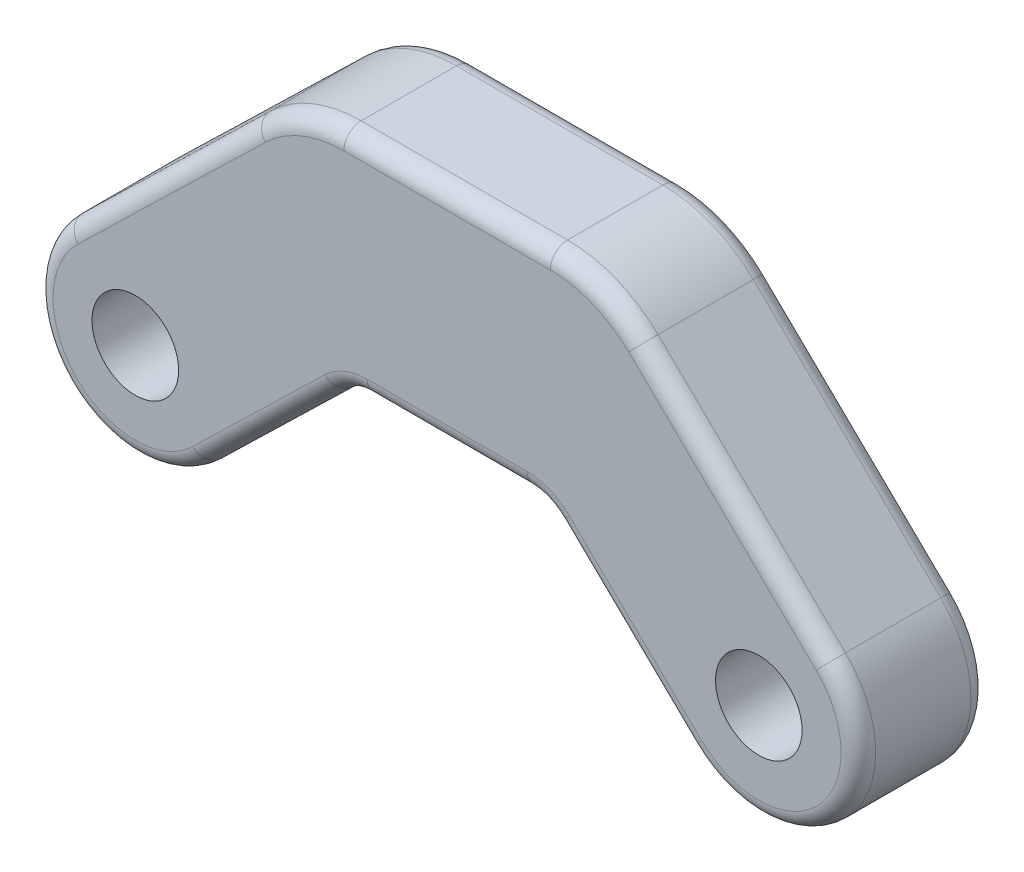
ISO-10303-21;
HEADER;
FILE_DESCRIPTION(('STEP AP214'),'2;1');
FILE_NAME('part.step','',(''),(''),'','','');
FILE_SCHEMA(('AUTOMOTIVE_DESIGN { 1 0 10303 214 1 1 1 1 }'));
ENDSEC;
DATA;
#1=APPLICATION_CONTEXT('core data for automotive mechanical design processes');
#2=APPLICATION_PROTOCOL_DEFINITION('international standard','automotive_design',2000,#1);
#3=PRODUCT_CONTEXT('',#1,'mechanical');
#4=PRODUCT('Part','Part','',(#3));
#5=PRODUCT_RELATED_PRODUCT_CATEGORY('part','',(#4));
#6=PRODUCT_DEFINITION_FORMATION('','',#4);
#7=PRODUCT_DEFINITION_CONTEXT('part definition',#1,'design');
#8=PRODUCT_DEFINITION('design','',#6,#7);
#9=PRODUCT_DEFINITION_SHAPE('','',#8);
#10=(LENGTH_UNIT() NAMED_UNIT(*) SI_UNIT(.MILLI.,.METRE.));
#11=(NAMED_UNIT(*) PLANE_ANGLE_UNIT() SI_UNIT($,.RADIAN.));
#12=(NAMED_UNIT(*) SI_UNIT($,.STERADIAN.) SOLID_ANGLE_UNIT());
#13=UNCERTAINTY_MEASURE_WITH_UNIT(LENGTH_MEASURE(1.E-05),#10,'distance_accuracy_value','');
#14=(GEOMETRIC_REPRESENTATION_CONTEXT(3) GLOBAL_UNCERTAINTY_ASSIGNED_CONTEXT((#13)) GLOBAL_UNIT_ASSIGNED_CONTEXT((#10,
#11,#12)) REPRESENTATION_CONTEXT('',''));
#15=CARTESIAN_POINT('',(0.,0.,0.));
#16=DIRECTION('',(0.,0.,1.));
#17=DIRECTION('',(1.,0.,0.));
#18=AXIS2_PLACEMENT_3D('',#15,#16,#17);
#19=CARTESIAN_POINT('',(0.,0.,15.));
#20=DIRECTION('',(0.,0.,-1.));
#21=DIRECTION('',(-1.,0.,0.));
#22=AXIS2_PLACEMENT_3D('',#19,#20,#21);
#23=CYLINDRICAL_SURFACE('',#22,11.5);
#24=DIRECTION('',(0.,0.,-1.));
#25=VECTOR('',#24,1.);
#26=CARTESIAN_POINT('',(8.00915787556776,-8.25247781725167,15.));
#27=LINE('',#26,#25);
#28=CARTESIAN_POINT('',(8.00915787556776,-8.25247781725167,13.));
#29=VERTEX_POINT('',#28);
#30=CARTESIAN_POINT('',(8.00915787556776,-8.25247781725167,2.));
#31=VERTEX_POINT('',#30);
#32=EDGE_CURVE('E334',#29,#31,#27,.T.);
#33=ORIENTED_EDGE('',*,*,#32,.F.);
#34=CARTESIAN_POINT('',(0.,0.,13.));
#35=DIRECTION('',(0.,0.,1.));
#36=DIRECTION('',(1.,0.,0.));
#37=AXIS2_PLACEMENT_3D('',#34,#35,#36);
#38=CIRCLE('',#37,11.5);
#39=CARTESIAN_POINT('',(-8.00915787556776,8.25247781725167,13.));
#40=VERTEX_POINT('',#39);
#41=EDGE_CURVE('E357',#29,#40,#38,.F.);
#42=ORIENTED_EDGE('',*,*,#41,.T.);
#43=DIRECTION('',(0.,0.,-1.));
#44=VECTOR('',#43,1.);
#45=CARTESIAN_POINT('',(-8.00915787556776,8.25247781725167,15.));
#46=LINE('',#45,#44);
#47=CARTESIAN_POINT('',(-8.00915787556776,8.25247781725167,2.));
#48=VERTEX_POINT('',#47);
#49=EDGE_CURVE('E448',#40,#48,#46,.T.);
#50=ORIENTED_EDGE('',*,*,#49,.T.);
#51=CARTESIAN_POINT('',(0.,0.,2.));
#52=DIRECTION('',(0.,0.,1.));
#53=DIRECTION('',(1.,0.,0.));
#54=AXIS2_PLACEMENT_3D('',#51,#52,#53);
#55=CIRCLE('',#54,11.5);
#56=EDGE_CURVE('E359',#48,#31,#55,.T.);
#57=ORIENTED_EDGE('',*,*,#56,.T.);
#58=EDGE_LOOP('',(#33,#42,#50,#57));
#59=FACE_BOUND('',#58,.T.);
#60=ADVANCED_FACE('F40',(#59),#23,.T.);
#61=CARTESIAN_POINT('',(8.00915787556776,-8.25247781725167,15.));
#62=DIRECTION('',(-0.696448510918936,0.717606766717537,0.));
#63=DIRECTION('',(-0.717606766717537,-0.696448510918936,0.));
#64=AXIS2_PLACEMENT_3D('',#61,#62,#63);
#65=PLANE('',#64);
#66=DIRECTION('',(0.,0.,-1.));
#67=VECTOR('',#66,1.);
#68=CARTESIAN_POINT('',(23.2951379972702,6.58280326906304,15.));
#69=LINE('',#68,#67);
#70=CARTESIAN_POINT('',(23.2951379972702,6.58280326906304,2.));
#71=VERTEX_POINT('',#70);
#72=CARTESIAN_POINT('',(23.2951379972702,6.58280326906304,13.));
#73=VERTEX_POINT('',#72);
#74=EDGE_CURVE('E427',#71,#73,#69,.F.);
#75=ORIENTED_EDGE('',*,*,#74,.T.);
#76=DIRECTION('',(0.717606766717537,0.696448510918936,0.));
#77=VECTOR('',#76,1.);
#78=CARTESIAN_POINT('',(8.00915787556776,-8.25247781725167,13.));
#79=LINE('',#78,#77);
#80=EDGE_CURVE('E365',#73,#29,#79,.F.);
#81=ORIENTED_EDGE('',*,*,#80,.T.);
#82=ORIENTED_EDGE('',*,*,#32,.T.);
#83=DIRECTION('',(0.717606766717537,0.696448510918936,0.));
#84=VECTOR('',#83,1.);
#85=CARTESIAN_POINT('',(8.00915787556776,-8.25247781725167,2.));
#86=LINE('',#85,#84);
#87=EDGE_CURVE('E367',#31,#71,#86,.T.);
#88=ORIENTED_EDGE('',*,*,#87,.T.);
#89=EDGE_LOOP('',(#75,#81,#82,#88));
#90=FACE_BOUND('',#89,.T.);
#91=ADVANCED_FACE('F488',(#90),#65,.F.);
#92=CARTESIAN_POINT('',(24.75,7.99476943547536,15.));
#93=DIRECTION('',(0.,1.,0.));
#94=DIRECTION('',(0.,0.,1.));
#95=AXIS2_PLACEMENT_3D('',#92,#93,#94);
#96=PLANE('',#95);
#97=DIRECTION('',(0.,0.,-1.));
#98=VECTOR('',#97,1.);
#99=CARTESIAN_POINT('',(45.2226194481351,7.99476943547536,15.));
#100=LINE('',#99,#98);
#101=CARTESIAN_POINT('',(45.2226194481351,7.99476943547536,2.));
#102=VERTEX_POINT('',#101);
#103=CARTESIAN_POINT('',(45.2226194481351,7.99476943547536,13.));
#104=VERTEX_POINT('',#103);
#105=EDGE_CURVE('E433',#102,#104,#100,.F.);
#106=ORIENTED_EDGE('',*,*,#105,.T.);
#107=DIRECTION('',(1.,0.,0.));
#108=VECTOR('',#107,1.);
#109=CARTESIAN_POINT('',(26.7773805518649,7.99476943547536,13.));
#110=LINE('',#109,#108);
#111=CARTESIAN_POINT('',(26.7773805518649,7.99476943547536,13.));
#112=VERTEX_POINT('',#111);
#113=EDGE_CURVE('E400',#104,#112,#110,.F.);
#114=ORIENTED_EDGE('',*,*,#113,.T.);
#115=DIRECTION('',(0.,0.,-1.));
#116=VECTOR('',#115,1.);
#117=CARTESIAN_POINT('',(26.7773805518649,7.99476943547536,0.));
#118=LINE('',#117,#116);
#119=CARTESIAN_POINT('',(26.7773805518649,7.99476943547536,2.));
#120=VERTEX_POINT('',#119);
#121=EDGE_CURVE('E430',#112,#120,#118,.T.);
#122=ORIENTED_EDGE('',*,*,#121,.T.);
#123=DIRECTION('',(1.,0.,0.));
#124=VECTOR('',#123,1.);
#125=CARTESIAN_POINT('',(24.75,7.99476943547536,2.));
#126=LINE('',#125,#124);
#127=EDGE_CURVE('E403',#120,#102,#126,.T.);
#128=ORIENTED_EDGE('',*,*,#127,.T.);
#129=EDGE_LOOP('',(#106,#114,#122,#128));
#130=FACE_BOUND('',#129,.T.);
#131=ADVANCED_FACE('F494',(#130),#96,.F.);
#132=CARTESIAN_POINT('',(47.25,7.99476943547536,15.));
#133=DIRECTION('',(0.696448510918936,0.717606766717537,0.));
#134=DIRECTION('',(-0.717606766717537,0.696448510918936,0.));
#135=AXIS2_PLACEMENT_3D('',#132,#133,#134);
#136=PLANE('',#135);
#137=DIRECTION('',(0.,0.,-1.));
#138=VECTOR('',#137,1.);
#139=CARTESIAN_POINT('',(63.9908421244322,-8.25247781725167,15.));
#140=LINE('',#139,#138);
#141=CARTESIAN_POINT('',(63.9908421244322,-8.25247781725167,13.));
#142=VERTEX_POINT('',#141);
#143=CARTESIAN_POINT('',(63.9908421244322,-8.25247781725167,2.));
#144=VERTEX_POINT('',#143);
#145=EDGE_CURVE('E443',#142,#144,#140,.T.);
#146=ORIENTED_EDGE('',*,*,#145,.F.);
#147=DIRECTION('',(0.717606766717537,-0.696448510918936,0.));
#148=VECTOR('',#147,1.);
#149=CARTESIAN_POINT('',(48.7048620027298,6.58280326906304,13.));
#150=LINE('',#149,#148);
#151=CARTESIAN_POINT('',(48.7048620027298,6.58280326906304,13.));
#152=VERTEX_POINT('',#151);
#153=EDGE_CURVE('E361',#142,#152,#150,.F.);
#154=ORIENTED_EDGE('',*,*,#153,.T.);
#155=DIRECTION('',(0.,0.,-1.));
#156=VECTOR('',#155,1.);
#157=CARTESIAN_POINT('',(48.7048620027298,6.58280326906304,0.));
#158=LINE('',#157,#156);
#159=CARTESIAN_POINT('',(48.7048620027298,6.58280326906304,2.));
#160=VERTEX_POINT('',#159);
#161=EDGE_CURVE('E224',#152,#160,#158,.T.);
#162=ORIENTED_EDGE('',*,*,#161,.T.);
#163=DIRECTION('',(0.717606766717537,-0.696448510918936,0.));
#164=VECTOR('',#163,1.);
#165=CARTESIAN_POINT('',(47.25,7.99476943547536,2.));
#166=LINE('',#165,#164);
#167=EDGE_CURVE('E363',#160,#144,#166,.T.);
#168=ORIENTED_EDGE('',*,*,#167,.T.);
#169=EDGE_LOOP('',(#146,#154,#162,#168));
#170=FACE_BOUND('',#169,.T.);
#171=ADVANCED_FACE('F711',(#170),#136,.F.);
#172=CARTESIAN_POINT('',(72.,0.,15.));
#173=DIRECTION('',(0.,0.,-1.));
#174=DIRECTION('',(-1.,0.,0.));
#175=AXIS2_PLACEMENT_3D('',#172,#173,#174);
#176=CYLINDRICAL_SURFACE('',#175,11.5);
#177=DIRECTION('',(0.,0.,-1.));
#178=VECTOR('',#177,1.);
#179=CARTESIAN_POINT('',(80.0091578755678,8.25247781725167,15.));
#180=LINE('',#179,#178);
#181=CARTESIAN_POINT('',(80.0091578755678,8.25247781725167,13.));
#182=VERTEX_POINT('',#181);
#183=CARTESIAN_POINT('',(80.0091578755678,8.25247781725167,2.));
#184=VERTEX_POINT('',#183);
#185=EDGE_CURVE('E446',#182,#184,#180,.T.);
#186=ORIENTED_EDGE('',*,*,#185,.F.);
#187=CARTESIAN_POINT('',(72.,0.,13.));
#188=DIRECTION('',(0.,0.,1.));
#189=DIRECTION('',(1.,0.,0.));
#190=AXIS2_PLACEMENT_3D('',#187,#188,#189);
#191=CIRCLE('',#190,11.5);
#192=EDGE_CURVE('E351',#182,#142,#191,.F.);
#193=ORIENTED_EDGE('',*,*,#192,.T.);
#194=ORIENTED_EDGE('',*,*,#145,.T.);
#195=CARTESIAN_POINT('',(72.,0.,2.));
#196=DIRECTION('',(0.,0.,1.));
#197=DIRECTION('',(1.,0.,0.));
#198=AXIS2_PLACEMENT_3D('',#195,#196,#197);
#199=CIRCLE('',#198,11.5);
#200=EDGE_CURVE('E353',#144,#184,#199,.T.);
#201=ORIENTED_EDGE('',*,*,#200,.T.);
#202=EDGE_LOOP('',(#186,#193,#194,#201));
#203=FACE_BOUND('',#202,.T.);
#204=ADVANCED_FACE('F720',(#203),#176,.T.);
#205=CARTESIAN_POINT('',(54.,33.4947694354754,15.));
#206=DIRECTION('',(0.696448510918936,0.717606766717537,0.));
#207=DIRECTION('',(-0.717606766717537,0.696448510918936,0.));
#208=AXIS2_PLACEMENT_3D('',#205,#206,#207);
#209=PLANE('',#208);
#210=DIRECTION('',(0.,0.,-1.));
#211=VECTOR('',#210,1.);
#212=CARTESIAN_POINT('',(58.3645860081893,29.2588709362384,15.));
#213=LINE('',#212,#211);
#214=CARTESIAN_POINT('',(58.3645860081893,29.2588709362384,2.));
#215=VERTEX_POINT('',#214);
#216=CARTESIAN_POINT('',(58.3645860081893,29.2588709362384,13.));
#217=VERTEX_POINT('',#216);
#218=EDGE_CURVE('E438',#215,#217,#213,.F.);
#219=ORIENTED_EDGE('',*,*,#218,.T.);
#220=DIRECTION('',(0.717606766717537,-0.696448510918936,0.));
#221=VECTOR('',#220,1.);
#222=CARTESIAN_POINT('',(54.,33.4947694354754,13.));
#223=LINE('',#222,#221);
#224=EDGE_CURVE('E306',#217,#182,#223,.T.);
#225=ORIENTED_EDGE('',*,*,#224,.T.);
#226=ORIENTED_EDGE('',*,*,#185,.T.);
#227=DIRECTION('',(0.717606766717537,-0.696448510918936,0.));
#228=VECTOR('',#227,1.);
#229=CARTESIAN_POINT('',(58.3645860081893,29.2588709362384,2.));
#230=LINE('',#229,#228);
#231=EDGE_CURVE('E313',#184,#215,#230,.F.);
#232=ORIENTED_EDGE('',*,*,#231,.T.);
#233=EDGE_LOOP('',(#219,#225,#226,#232));
#234=FACE_BOUND('',#233,.T.);
#235=ADVANCED_FACE('F683',(#234),#209,.T.);
#236=CARTESIAN_POINT('',(18.,33.4947694354754,15.));
#237=DIRECTION('',(0.,1.,0.));
#238=DIRECTION('',(0.,0.,1.));
#239=AXIS2_PLACEMENT_3D('',#236,#237,#238);
#240=PLANE('',#239);
#241=DIRECTION('',(0.,0.,-1.));
#242=VECTOR('',#241,1.);
#243=CARTESIAN_POINT('',(24.0821416555947,33.4947694354754,15.));
#244=LINE('',#243,#242);
#245=CARTESIAN_POINT('',(24.0821416555947,33.4947694354754,2.));
#246=VERTEX_POINT('',#245);
#247=CARTESIAN_POINT('',(24.0821416555947,33.4947694354754,13.));
#248=VERTEX_POINT('',#247);
#249=EDGE_CURVE('E326',#246,#248,#244,.F.);
#250=ORIENTED_EDGE('',*,*,#249,.T.);
#251=DIRECTION('',(1.,0.,0.));
#252=VECTOR('',#251,1.);
#253=CARTESIAN_POINT('',(18.,33.4947694354754,13.));
#254=LINE('',#253,#252);
#255=CARTESIAN_POINT('',(47.9178583444053,33.4947694354754,13.));
#256=VERTEX_POINT('',#255);
#257=EDGE_CURVE('E11',#248,#256,#254,.T.);
#258=ORIENTED_EDGE('',*,*,#257,.T.);
#259=DIRECTION('',(0.,0.,-1.));
#260=VECTOR('',#259,1.);
#261=CARTESIAN_POINT('',(47.9178583444053,33.4947694354754,15.));
#262=LINE('',#261,#260);
#263=CARTESIAN_POINT('',(47.9178583444053,33.4947694354754,2.));
#264=VERTEX_POINT('',#263);
#265=EDGE_CURVE('E327',#256,#264,#262,.T.);
#266=ORIENTED_EDGE('',*,*,#265,.T.);
#267=DIRECTION('',(1.,0.,0.));
#268=VECTOR('',#267,1.);
#269=CARTESIAN_POINT('',(24.0821416555947,33.4947694354754,2.));
#270=LINE('',#269,#268);
#271=EDGE_CURVE('E49',#264,#246,#270,.F.);
#272=ORIENTED_EDGE('',*,*,#271,.T.);
#273=EDGE_LOOP('',(#250,#258,#266,#272));
#274=FACE_BOUND('',#273,.T.);
#275=ADVANCED_FACE('F325',(#274),#240,.T.);
#276=CARTESIAN_POINT('',(-8.00915787556776,8.25247781725167,15.));
#277=DIRECTION('',(-0.696448510918936,0.717606766717537,0.));
#278=DIRECTION('',(-0.717606766717537,-0.696448510918936,0.));
#279=AXIS2_PLACEMENT_3D('',#276,#277,#278);
#280=PLANE('',#279);
#281=ORIENTED_EDGE('',*,*,#49,.F.);
#282=DIRECTION('',(0.717606766717537,0.696448510918936,0.));
#283=VECTOR('',#282,1.);
#284=CARTESIAN_POINT('',(-8.00915787556776,8.25247781725167,13.));
#285=LINE('',#284,#283);
#286=CARTESIAN_POINT('',(13.6354139918106,29.2588709362384,13.));
#287=VERTEX_POINT('',#286);
#288=EDGE_CURVE('E317',#40,#287,#285,.T.);
#289=ORIENTED_EDGE('',*,*,#288,.T.);
#290=DIRECTION('',(0.,0.,-1.));
#291=VECTOR('',#290,1.);
#292=CARTESIAN_POINT('',(13.6354139918106,29.2588709362384,15.));
#293=LINE('',#292,#291);
#294=CARTESIAN_POINT('',(13.6354139918106,29.2588709362384,2.));
#295=VERTEX_POINT('',#294);
#296=EDGE_CURVE('E436',#287,#295,#293,.T.);
#297=ORIENTED_EDGE('',*,*,#296,.T.);
#298=DIRECTION('',(0.717606766717537,0.696448510918936,0.));
#299=VECTOR('',#298,1.);
#300=CARTESIAN_POINT('',(-8.00915787556776,8.25247781725167,2.));
#301=LINE('',#300,#299);
#302=EDGE_CURVE('E345',#295,#48,#301,.F.);
#303=ORIENTED_EDGE('',*,*,#302,.T.);
#304=EDGE_LOOP('',(#281,#289,#297,#303));
#305=FACE_BOUND('',#304,.T.);
#306=ADVANCED_FACE('F474',(#305),#280,.T.);
#307=CARTESIAN_POINT('',(0.,0.,15.));
#308=DIRECTION('',(0.,0.,1.));
#309=DIRECTION('',(1.,0.,0.));
#310=AXIS2_PLACEMENT_3D('',#307,#308,#309);
#311=PLANE('',#310);
#312=CARTESIAN_POINT('',(26.7773805518649,2.99476943547536,15.));
#313=DIRECTION('',(0.,0.,1.));
#314=DIRECTION('',(1.,0.,0.));
#315=AXIS2_PLACEMENT_3D('',#312,#313,#314);
#316=CIRCLE('',#315,7.);
#317=CARTESIAN_POINT('',(21.9022409754323,8.01801680249812,15.));
#318=VERTEX_POINT('',#317);
#319=CARTESIAN_POINT('',(26.7773805518649,9.99476943547536,15.));
#320=VERTEX_POINT('',#319);
#321=EDGE_CURVE('E409',#318,#320,#316,.F.);
#322=ORIENTED_EDGE('',*,*,#321,.T.);
#323=DIRECTION('',(1.,0.,0.));
#324=VECTOR('',#323,1.);
#325=CARTESIAN_POINT('',(45.2226194481351,9.99476943547536,15.));
#326=LINE('',#325,#324);
#327=CARTESIAN_POINT('',(45.2226194481351,9.99476943547536,15.));
#328=VERTEX_POINT('',#327);
#329=EDGE_CURVE('E406',#320,#328,#326,.T.);
#330=ORIENTED_EDGE('',*,*,#329,.T.);
#331=CARTESIAN_POINT('',(45.2226194481351,2.99476943547536,15.));
#332=DIRECTION('',(0.,0.,1.));
#333=DIRECTION('',(1.,0.,0.));
#334=AXIS2_PLACEMENT_3D('',#331,#332,#333);
#335=CIRCLE('',#334,7.);
#336=CARTESIAN_POINT('',(50.0977590245676,8.01801680249812,15.));
#337=VERTEX_POINT('',#336);
#338=EDGE_CURVE('E411',#328,#337,#335,.F.);
#339=ORIENTED_EDGE('',*,*,#338,.T.);
#340=DIRECTION('',(0.717606766717537,-0.696448510918936,0.));
#341=VECTOR('',#340,1.);
#342=CARTESIAN_POINT('',(65.3837391462701,-6.81726428381661,15.));
#343=LINE('',#342,#341);
#344=CARTESIAN_POINT('',(65.3837391462701,-6.8172642838166,15.));
#345=VERTEX_POINT('',#344);
#346=EDGE_CURVE('E415',#337,#345,#343,.T.);
#347=ORIENTED_EDGE('',*,*,#346,.T.);
#348=CARTESIAN_POINT('',(72.,0.,15.));
#349=DIRECTION('',(0.,0.,1.));
#350=DIRECTION('',(1.,0.,0.));
#351=AXIS2_PLACEMENT_3D('',#348,#349,#350);
#352=CIRCLE('',#351,9.5);
#353=CARTESIAN_POINT('',(78.6162608537299,6.8172642838166,15.));
#354=VERTEX_POINT('',#353);
#355=EDGE_CURVE('E419',#345,#354,#352,.T.);
#356=ORIENTED_EDGE('',*,*,#355,.T.);
#357=DIRECTION('',(0.717606766717537,-0.696448510918936,0.));
#358=VECTOR('',#357,1.);
#359=CARTESIAN_POINT('',(41.5391788957365,42.8011480994328,15.));
#360=LINE('',#359,#358);
#361=CARTESIAN_POINT('',(56.9716889863515,27.8236574028033,15.));
#362=VERTEX_POINT('',#361);
#363=EDGE_CURVE('E209',#354,#362,#360,.F.);
#364=ORIENTED_EDGE('',*,*,#363,.T.);
#365=CARTESIAN_POINT('',(47.9178583444053,18.4947694354754,15.));
#366=DIRECTION('',(0.,0.,1.));
#367=DIRECTION('',(1.,0.,0.));
#368=AXIS2_PLACEMENT_3D('',#365,#366,#367);
#369=CIRCLE('',#368,13.);
#370=CARTESIAN_POINT('',(47.9178583444053,31.4947694354754,15.));
#371=VERTEX_POINT('',#370);
#372=EDGE_CURVE('E202',#362,#371,#369,.T.);
#373=ORIENTED_EDGE('',*,*,#372,.T.);
#374=DIRECTION('',(1.,0.,0.));
#375=VECTOR('',#374,1.);
#376=CARTESIAN_POINT('',(0.,31.4947694354754,15.));
#377=LINE('',#376,#375);
#378=CARTESIAN_POINT('',(24.0821416555947,31.4947694354754,15.));
#379=VERTEX_POINT('',#378);
#380=EDGE_CURVE('E206',#371,#379,#377,.F.);
#381=ORIENTED_EDGE('',*,*,#380,.T.);
#382=CARTESIAN_POINT('',(24.0821416555947,18.4947694354754,15.));
#383=DIRECTION('',(0.,0.,1.));
#384=DIRECTION('',(1.,0.,0.));
#385=AXIS2_PLACEMENT_3D('',#382,#383,#384);
#386=CIRCLE('',#385,13.);
#387=CARTESIAN_POINT('',(15.0283110136485,27.8236574028033,15.));
#388=VERTEX_POINT('',#387);
#389=EDGE_CURVE('E214',#379,#388,#386,.T.);
#390=ORIENTED_EDGE('',*,*,#389,.T.);
#391=DIRECTION('',(0.717606766717537,0.696448510918936,0.));
#392=VECTOR('',#391,1.);
#393=CARTESIAN_POINT('',(-6.61626085372989,6.8172642838166,15.));
#394=LINE('',#393,#392);
#395=CARTESIAN_POINT('',(-6.61626085372989,6.8172642838166,15.));
#396=VERTEX_POINT('',#395);
#397=EDGE_CURVE('E421',#388,#396,#394,.F.);
#398=ORIENTED_EDGE('',*,*,#397,.T.);
#399=CARTESIAN_POINT('',(0.,0.,15.));
#400=DIRECTION('',(0.,0.,1.));
#401=DIRECTION('',(1.,0.,0.));
#402=AXIS2_PLACEMENT_3D('',#399,#400,#401);
#403=CIRCLE('',#402,9.5);
#404=CARTESIAN_POINT('',(6.61626085372989,-6.8172642838166,15.));
#405=VERTEX_POINT('',#404);
#406=EDGE_CURVE('E417',#396,#405,#403,.T.);
#407=ORIENTED_EDGE('',*,*,#406,.T.);
#408=DIRECTION('',(0.717606766717537,0.696448510918936,0.));
#409=VECTOR('',#408,1.);
#410=CARTESIAN_POINT('',(21.9022409754323,8.01801680249812,15.));
#411=LINE('',#410,#409);
#412=EDGE_CURVE('E413',#405,#318,#411,.T.);
#413=ORIENTED_EDGE('',*,*,#412,.T.);
#414=EDGE_LOOP('',(#322,#330,#339,#347,#356,#364,#373,#381,#390,#398,#407,#413));
#415=FACE_BOUND('',#414,.T.);
#416=CARTESIAN_POINT('',(72.,0.,15.));
#417=DIRECTION('',(0.,0.,1.));
#418=DIRECTION('',(1.,0.,0.));
#419=AXIS2_PLACEMENT_3D('',#416,#417,#418);
#420=CIRCLE('',#419,5.);
#421=CARTESIAN_POINT('',(77.,0.,15.));
#422=VERTEX_POINT('',#421);
#423=EDGE_CURVE('E230',#422,#422,#420,.T.);
#424=ORIENTED_EDGE('',*,*,#423,.F.);
#425=EDGE_LOOP('',(#424));
#426=FACE_BOUND('',#425,.T.);
#427=CARTESIAN_POINT('',(0.,0.,15.));
#428=DIRECTION('',(0.,0.,1.));
#429=DIRECTION('',(1.,0.,0.));
#430=AXIS2_PLACEMENT_3D('',#427,#428,#429);
#431=CIRCLE('',#430,5.);
#432=CARTESIAN_POINT('',(5.,0.,15.));
#433=VERTEX_POINT('',#432);
#434=EDGE_CURVE('E451',#433,#433,#431,.T.);
#435=ORIENTED_EDGE('',*,*,#434,.F.);
#436=EDGE_LOOP('',(#435));
#437=FACE_BOUND('',#436,.T.);
#438=ADVANCED_FACE('F204',(#415,#426,#437),#311,.T.);
#439=CARTESIAN_POINT('',(0.,0.,0.));
#440=DIRECTION('',(0.,0.,1.));
#441=DIRECTION('',(1.,0.,0.));
#442=AXIS2_PLACEMENT_3D('',#439,#440,#441);
#443=PLANE('',#442);
#444=CARTESIAN_POINT('',(45.2226194481351,2.99476943547536,0.));
#445=DIRECTION('',(0.,0.,1.));
#446=DIRECTION('',(1.,0.,0.));
#447=AXIS2_PLACEMENT_3D('',#444,#445,#446);
#448=CIRCLE('',#447,7.);
#449=CARTESIAN_POINT('',(50.0977590245676,8.01801680249812,0.));
#450=VERTEX_POINT('',#449);
#451=CARTESIAN_POINT('',(45.2226194481351,9.99476943547536,0.));
#452=VERTEX_POINT('',#451);
#453=EDGE_CURVE('E382',#450,#452,#448,.T.);
#454=ORIENTED_EDGE('',*,*,#453,.T.);
#455=DIRECTION('',(1.,0.,0.));
#456=VECTOR('',#455,1.);
#457=CARTESIAN_POINT('',(0.,9.99476943547536,0.));
#458=LINE('',#457,#456);
#459=CARTESIAN_POINT('',(26.7773805518649,9.99476943547536,0.));
#460=VERTEX_POINT('',#459);
#461=EDGE_CURVE('E377',#452,#460,#458,.F.);
#462=ORIENTED_EDGE('',*,*,#461,.T.);
#463=CARTESIAN_POINT('',(26.7773805518649,2.99476943547536,0.));
#464=DIRECTION('',(0.,0.,1.));
#465=DIRECTION('',(1.,0.,0.));
#466=AXIS2_PLACEMENT_3D('',#463,#464,#465);
#467=CIRCLE('',#466,7.);
#468=CARTESIAN_POINT('',(21.9022409754323,8.01801680249812,0.));
#469=VERTEX_POINT('',#468);
#470=EDGE_CURVE('E380',#460,#469,#467,.T.);
#471=ORIENTED_EDGE('',*,*,#470,.T.);
#472=DIRECTION('',(0.717606766717537,0.696448510918936,0.));
#473=VECTOR('',#472,1.);
#474=CARTESIAN_POINT('',(6.61626085372989,-6.8172642838166,0.));
#475=LINE('',#474,#473);
#476=CARTESIAN_POINT('',(6.61626085372989,-6.8172642838166,0.));
#477=VERTEX_POINT('',#476);
#478=EDGE_CURVE('E384',#469,#477,#475,.F.);
#479=ORIENTED_EDGE('',*,*,#478,.T.);
#480=CARTESIAN_POINT('',(0.,0.,0.));
#481=DIRECTION('',(0.,0.,1.));
#482=DIRECTION('',(1.,0.,0.));
#483=AXIS2_PLACEMENT_3D('',#480,#481,#482);
#484=CIRCLE('',#483,9.5);
#485=CARTESIAN_POINT('',(-6.61626085372989,6.8172642838166,0.));
#486=VERTEX_POINT('',#485);
#487=EDGE_CURVE('E388',#477,#486,#484,.F.);
#488=ORIENTED_EDGE('',*,*,#487,.T.);
#489=DIRECTION('',(0.717606766717537,0.696448510918936,0.));
#490=VECTOR('',#489,1.);
#491=CARTESIAN_POINT('',(15.0283110136485,27.8236574028033,0.));
#492=LINE('',#491,#490);
#493=CARTESIAN_POINT('',(15.0283110136485,27.8236574028033,0.));
#494=VERTEX_POINT('',#493);
#495=EDGE_CURVE('E392',#486,#494,#492,.T.);
#496=ORIENTED_EDGE('',*,*,#495,.T.);
#497=CARTESIAN_POINT('',(24.0821416555947,18.4947694354754,0.));
#498=DIRECTION('',(0.,0.,1.));
#499=DIRECTION('',(1.,0.,0.));
#500=AXIS2_PLACEMENT_3D('',#497,#498,#499);
#501=CIRCLE('',#500,13.);
#502=CARTESIAN_POINT('',(24.0821416555947,31.4947694354754,0.));
#503=VERTEX_POINT('',#502);
#504=EDGE_CURVE('E341',#494,#503,#501,.F.);
#505=ORIENTED_EDGE('',*,*,#504,.T.);
#506=DIRECTION('',(1.,0.,0.));
#507=VECTOR('',#506,1.);
#508=CARTESIAN_POINT('',(47.9178583444053,31.4947694354754,0.));
#509=LINE('',#508,#507);
#510=CARTESIAN_POINT('',(47.9178583444053,31.4947694354754,0.));
#511=VERTEX_POINT('',#510);
#512=EDGE_CURVE('E337',#503,#511,#509,.T.);
#513=ORIENTED_EDGE('',*,*,#512,.T.);
#514=CARTESIAN_POINT('',(47.9178583444053,18.4947694354754,0.));
#515=DIRECTION('',(0.,0.,1.));
#516=DIRECTION('',(1.,0.,0.));
#517=AXIS2_PLACEMENT_3D('',#514,#515,#516);
#518=CIRCLE('',#517,13.);
#519=CARTESIAN_POINT('',(56.9716889863515,27.8236574028033,0.));
#520=VERTEX_POINT('',#519);
#521=EDGE_CURVE('E397',#511,#520,#518,.F.);
#522=ORIENTED_EDGE('',*,*,#521,.T.);
#523=DIRECTION('',(0.717606766717537,-0.696448510918936,0.));
#524=VECTOR('',#523,1.);
#525=CARTESIAN_POINT('',(78.6162608537299,6.81726428381661,0.));
#526=LINE('',#525,#524);
#527=CARTESIAN_POINT('',(78.6162608537299,6.8172642838166,0.));
#528=VERTEX_POINT('',#527);
#529=EDGE_CURVE('E394',#520,#528,#526,.T.);
#530=ORIENTED_EDGE('',*,*,#529,.T.);
#531=CARTESIAN_POINT('',(72.,0.,0.));
#532=DIRECTION('',(0.,0.,1.));
#533=DIRECTION('',(1.,0.,0.));
#534=AXIS2_PLACEMENT_3D('',#531,#532,#533);
#535=CIRCLE('',#534,9.5);
#536=CARTESIAN_POINT('',(65.3837391462701,-6.8172642838166,0.));
#537=VERTEX_POINT('',#536);
#538=EDGE_CURVE('E390',#528,#537,#535,.F.);
#539=ORIENTED_EDGE('',*,*,#538,.T.);
#540=DIRECTION('',(0.717606766717537,-0.696448510918936,0.));
#541=VECTOR('',#540,1.);
#542=CARTESIAN_POINT('',(28.3066571882767,29.1666195317996,0.));
#543=LINE('',#542,#541);
#544=EDGE_CURVE('E386',#537,#450,#543,.F.);
#545=ORIENTED_EDGE('',*,*,#544,.T.);
#546=EDGE_LOOP('',(#454,#462,#471,#479,#488,#496,#505,#513,#522,#530,#539,#545));
#547=FACE_BOUND('',#546,.T.);
#548=CARTESIAN_POINT('',(72.,0.,0.));
#549=DIRECTION('',(0.,0.,1.));
#550=DIRECTION('',(1.,0.,0.));
#551=AXIS2_PLACEMENT_3D('',#548,#549,#550);
#552=CIRCLE('',#551,5.);
#553=CARTESIAN_POINT('',(77.,0.,0.));
#554=VERTEX_POINT('',#553);
#555=EDGE_CURVE('E454',#554,#554,#552,.T.);
#556=ORIENTED_EDGE('',*,*,#555,.T.);
#557=EDGE_LOOP('',(#556));
#558=FACE_BOUND('',#557,.T.);
#559=CARTESIAN_POINT('',(0.,0.,0.));
#560=DIRECTION('',(0.,0.,1.));
#561=DIRECTION('',(1.,0.,0.));
#562=AXIS2_PLACEMENT_3D('',#559,#560,#561);
#563=CIRCLE('',#562,5.);
#564=CARTESIAN_POINT('',(5.,0.,0.));
#565=VERTEX_POINT('',#564);
#566=EDGE_CURVE('E450',#565,#565,#563,.T.);
#567=ORIENTED_EDGE('',*,*,#566,.T.);
#568=EDGE_LOOP('',(#567));
#569=FACE_BOUND('',#568,.T.);
#570=ADVANCED_FACE('F462',(#547,#558,#569),#443,.F.);
#571=CARTESIAN_POINT('',(0.,0.,0.));
#572=DIRECTION('',(0.,0.,1.));
#573=DIRECTION('',(1.,0.,0.));
#574=AXIS2_PLACEMENT_3D('',#571,#572,#573);
#575=CYLINDRICAL_SURFACE('',#574,5.);
#576=ORIENTED_EDGE('',*,*,#566,.F.);
#577=EDGE_LOOP('',(#576));
#578=FACE_BOUND('',#577,.T.);
#579=ORIENTED_EDGE('',*,*,#434,.T.);
#580=EDGE_LOOP('',(#579));
#581=FACE_BOUND('',#580,.T.);
#582=ADVANCED_FACE('F469',(#578,#581),#575,.F.);
#583=CARTESIAN_POINT('',(72.,0.,0.));
#584=DIRECTION('',(0.,0.,1.));
#585=DIRECTION('',(1.,0.,0.));
#586=AXIS2_PLACEMENT_3D('',#583,#584,#585);
#587=CYLINDRICAL_SURFACE('',#586,5.);
#588=ORIENTED_EDGE('',*,*,#555,.F.);
#589=EDGE_LOOP('',(#588));
#590=FACE_BOUND('',#589,.T.);
#591=ORIENTED_EDGE('',*,*,#423,.T.);
#592=EDGE_LOOP('',(#591));
#593=FACE_BOUND('',#592,.T.);
#594=ADVANCED_FACE('F465',(#590,#593),#587,.F.);
#595=CARTESIAN_POINT('',(47.9178583444053,18.4947694354754,15.));
#596=DIRECTION('',(0.,0.,-1.));
#597=DIRECTION('',(-1.,0.,0.));
#598=AXIS2_PLACEMENT_3D('',#595,#596,#597);
#599=CYLINDRICAL_SURFACE('',#598,15.);
#600=ORIENTED_EDGE('',*,*,#265,.F.);
#601=CARTESIAN_POINT('',(47.9178583444053,18.4947694354754,13.));
#602=DIRECTION('',(0.,0.,1.));
#603=DIRECTION('',(1.,0.,0.));
#604=AXIS2_PLACEMENT_3D('',#601,#602,#603);
#605=CIRCLE('',#604,15.);
#606=EDGE_CURVE('E227',#256,#217,#605,.F.);
#607=ORIENTED_EDGE('',*,*,#606,.T.);
#608=ORIENTED_EDGE('',*,*,#218,.F.);
#609=CARTESIAN_POINT('',(47.9178583444053,18.4947694354754,2.));
#610=DIRECTION('',(0.,0.,1.));
#611=DIRECTION('',(1.,0.,0.));
#612=AXIS2_PLACEMENT_3D('',#609,#610,#611);
#613=CIRCLE('',#612,15.);
#614=EDGE_CURVE('E57',#215,#264,#613,.T.);
#615=ORIENTED_EDGE('',*,*,#614,.T.);
#616=EDGE_LOOP('',(#600,#607,#608,#615));
#617=FACE_BOUND('',#616,.T.);
#618=ADVANCED_FACE('F468',(#617),#599,.T.);
#619=CARTESIAN_POINT('',(24.0821416555947,18.4947694354754,15.));
#620=DIRECTION('',(0.,0.,-1.));
#621=DIRECTION('',(-1.,0.,0.));
#622=AXIS2_PLACEMENT_3D('',#619,#620,#621);
#623=CYLINDRICAL_SURFACE('',#622,15.);
#624=ORIENTED_EDGE('',*,*,#296,.F.);
#625=CARTESIAN_POINT('',(24.0821416555947,18.4947694354754,13.));
#626=DIRECTION('',(0.,0.,1.));
#627=DIRECTION('',(1.,0.,0.));
#628=AXIS2_PLACEMENT_3D('',#625,#626,#627);
#629=CIRCLE('',#628,15.);
#630=EDGE_CURVE('E315',#287,#248,#629,.F.);
#631=ORIENTED_EDGE('',*,*,#630,.T.);
#632=ORIENTED_EDGE('',*,*,#249,.F.);
#633=CARTESIAN_POINT('',(24.0821416555947,18.4947694354754,2.));
#634=DIRECTION('',(0.,0.,1.));
#635=DIRECTION('',(1.,0.,0.));
#636=AXIS2_PLACEMENT_3D('',#633,#634,#635);
#637=CIRCLE('',#636,15.);
#638=EDGE_CURVE('E312',#246,#295,#637,.T.);
#639=ORIENTED_EDGE('',*,*,#638,.T.);
#640=EDGE_LOOP('',(#624,#631,#632,#639));
#641=FACE_BOUND('',#640,.T.);
#642=ADVANCED_FACE('F331',(#641),#623,.T.);
#643=CARTESIAN_POINT('',(26.7773805518649,2.99476943547536,15.));
#644=DIRECTION('',(0.,0.,1.));
#645=DIRECTION('',(1.,0.,0.));
#646=AXIS2_PLACEMENT_3D('',#643,#644,#645);
#647=CYLINDRICAL_SURFACE('',#646,5.);
#648=ORIENTED_EDGE('',*,*,#121,.F.);
#649=CARTESIAN_POINT('',(26.7773805518649,2.99476943547536,13.));
#650=DIRECTION('',(0.,0.,1.));
#651=DIRECTION('',(1.,0.,0.));
#652=AXIS2_PLACEMENT_3D('',#649,#650,#651);
#653=CIRCLE('',#652,5.);
#654=EDGE_CURVE('E373',#112,#73,#653,.T.);
#655=ORIENTED_EDGE('',*,*,#654,.T.);
#656=ORIENTED_EDGE('',*,*,#74,.F.);
#657=CARTESIAN_POINT('',(26.7773805518649,2.99476943547536,2.));
#658=DIRECTION('',(0.,0.,1.));
#659=DIRECTION('',(1.,0.,0.));
#660=AXIS2_PLACEMENT_3D('',#657,#658,#659);
#661=CIRCLE('',#660,5.);
#662=EDGE_CURVE('E375',#71,#120,#661,.F.);
#663=ORIENTED_EDGE('',*,*,#662,.T.);
#664=EDGE_LOOP('',(#648,#655,#656,#663));
#665=FACE_BOUND('',#664,.T.);
#666=ADVANCED_FACE('F504',(#665),#647,.F.);
#667=CARTESIAN_POINT('',(45.2226194481351,2.99476943547536,15.));
#668=DIRECTION('',(0.,0.,1.));
#669=DIRECTION('',(1.,0.,0.));
#670=AXIS2_PLACEMENT_3D('',#667,#668,#669);
#671=CYLINDRICAL_SURFACE('',#670,5.);
#672=ORIENTED_EDGE('',*,*,#161,.F.);
#673=CARTESIAN_POINT('',(45.2226194481351,2.99476943547536,13.));
#674=DIRECTION('',(0.,0.,1.));
#675=DIRECTION('',(1.,0.,0.));
#676=AXIS2_PLACEMENT_3D('',#673,#674,#675);
#677=CIRCLE('',#676,5.);
#678=EDGE_CURVE('E369',#152,#104,#677,.T.);
#679=ORIENTED_EDGE('',*,*,#678,.T.);
#680=ORIENTED_EDGE('',*,*,#105,.F.);
#681=CARTESIAN_POINT('',(45.2226194481351,2.99476943547536,2.));
#682=DIRECTION('',(0.,0.,1.));
#683=DIRECTION('',(1.,0.,0.));
#684=AXIS2_PLACEMENT_3D('',#681,#682,#683);
#685=CIRCLE('',#684,5.);
#686=EDGE_CURVE('E371',#102,#160,#685,.F.);
#687=ORIENTED_EDGE('',*,*,#686,.T.);
#688=EDGE_LOOP('',(#672,#679,#680,#687));
#689=FACE_BOUND('',#688,.T.);
#690=ADVANCED_FACE('F507',(#689),#671,.F.);
#691=CARTESIAN_POINT('',(18.,31.4947694354754,13.));
#692=DIRECTION('',(1.,0.,0.));
#693=DIRECTION('',(0.,0.,-1.));
#694=AXIS2_PLACEMENT_3D('',#691,#692,#693);
#695=CYLINDRICAL_SURFACE('',#694,2.);
#696=CARTESIAN_POINT('',(47.9178583444053,31.4947694354754,13.));
#697=DIRECTION('',(1.,0.,0.));
#698=DIRECTION('',(0.,0.,-1.));
#699=AXIS2_PLACEMENT_3D('',#696,#697,#698);
#700=CIRCLE('',#699,2.);
#701=EDGE_CURVE('E219',#256,#371,#700,.T.);
#702=ORIENTED_EDGE('',*,*,#701,.F.);
#703=ORIENTED_EDGE('',*,*,#257,.F.);
#704=CARTESIAN_POINT('',(24.0821416555947,31.4947694354754,13.));
#705=DIRECTION('',(-1.,0.,0.));
#706=DIRECTION('',(0.,0.,1.));
#707=AXIS2_PLACEMENT_3D('',#704,#705,#706);
#708=CIRCLE('',#707,2.);
#709=EDGE_CURVE('E222',#379,#248,#708,.T.);
#710=ORIENTED_EDGE('',*,*,#709,.F.);
#711=ORIENTED_EDGE('',*,*,#380,.F.);
#712=EDGE_LOOP('',(#702,#703,#710,#711));
#713=FACE_BOUND('',#712,.T.);
#714=ADVANCED_FACE('F218',(#713),#695,.T.);
#715=CARTESIAN_POINT('',(24.0821416555947,18.4947694354754,13.));
#716=DIRECTION('',(0.,0.,1.));
#717=DIRECTION('',(1.,0.,0.));
#718=AXIS2_PLACEMENT_3D('',#715,#716,#717);
#719=TOROIDAL_SURFACE('',#718,13.,2.);
#720=ORIENTED_EDGE('',*,*,#709,.T.);
#721=ORIENTED_EDGE('',*,*,#630,.F.);
#722=CARTESIAN_POINT('',(15.0283110136485,27.8236574028033,13.));
#723=DIRECTION('',(-0.717606766717537,-0.696448510918936,0.));
#724=DIRECTION('',(0.696448510918936,-0.717606766717537,0.));
#725=AXIS2_PLACEMENT_3D('',#722,#723,#724);
#726=CIRCLE('',#725,2.);
#727=EDGE_CURVE('E228',#388,#287,#726,.T.);
#728=ORIENTED_EDGE('',*,*,#727,.F.);
#729=ORIENTED_EDGE('',*,*,#389,.F.);
#730=EDGE_LOOP('',(#720,#721,#728,#729));
#731=FACE_BOUND('',#730,.T.);
#732=ADVANCED_FACE('F547',(#731),#719,.T.);
#733=CARTESIAN_POINT('',(47.9178583444053,18.4947694354754,13.));
#734=DIRECTION('',(0.,0.,1.));
#735=DIRECTION('',(1.,0.,0.));
#736=AXIS2_PLACEMENT_3D('',#733,#734,#735);
#737=TOROIDAL_SURFACE('',#736,13.,2.);
#738=ORIENTED_EDGE('',*,*,#701,.T.);
#739=ORIENTED_EDGE('',*,*,#372,.F.);
#740=CARTESIAN_POINT('',(56.9716889863515,27.8236574028033,13.));
#741=DIRECTION('',(0.717606766717538,-0.696448510918935,0.));
#742=DIRECTION('',(0.696448510918935,0.717606766717538,0.));
#743=AXIS2_PLACEMENT_3D('',#740,#741,#742);
#744=CIRCLE('',#743,2.);
#745=EDGE_CURVE('E233',#217,#362,#744,.T.);
#746=ORIENTED_EDGE('',*,*,#745,.F.);
#747=ORIENTED_EDGE('',*,*,#606,.F.);
#748=EDGE_LOOP('',(#738,#739,#746,#747));
#749=FACE_BOUND('',#748,.T.);
#750=ADVANCED_FACE('F226',(#749),#737,.T.);
#751=CARTESIAN_POINT('',(-6.61626085372989,6.8172642838166,13.));
#752=DIRECTION('',(0.717606766717537,0.696448510918936,0.));
#753=DIRECTION('',(-0.696448510918936,0.717606766717537,0.));
#754=AXIS2_PLACEMENT_3D('',#751,#752,#753);
#755=CYLINDRICAL_SURFACE('',#754,2.);
#756=ORIENTED_EDGE('',*,*,#727,.T.);
#757=ORIENTED_EDGE('',*,*,#288,.F.);
#758=CARTESIAN_POINT('',(-6.61626085372989,6.8172642838166,13.));
#759=DIRECTION('',(-0.717606766717537,-0.696448510918936,0.));
#760=DIRECTION('',(0.696448510918936,-0.717606766717537,0.));
#761=AXIS2_PLACEMENT_3D('',#758,#759,#760);
#762=CIRCLE('',#761,2.);
#763=EDGE_CURVE('E300',#396,#40,#762,.T.);
#764=ORIENTED_EDGE('',*,*,#763,.F.);
#765=ORIENTED_EDGE('',*,*,#397,.F.);
#766=EDGE_LOOP('',(#756,#757,#764,#765));
#767=FACE_BOUND('',#766,.T.);
#768=ADVANCED_FACE('F541',(#767),#755,.T.);
#769=CARTESIAN_POINT('',(52.6071029781621,32.0595559020403,13.));
#770=DIRECTION('',(0.717606766717537,-0.696448510918936,0.));
#771=DIRECTION('',(0.696448510918936,0.717606766717537,0.));
#772=AXIS2_PLACEMENT_3D('',#769,#770,#771);
#773=CYLINDRICAL_SURFACE('',#772,2.);
#774=ORIENTED_EDGE('',*,*,#745,.T.);
#775=ORIENTED_EDGE('',*,*,#363,.F.);
#776=CARTESIAN_POINT('',(78.6162608537299,6.8172642838166,13.));
#777=DIRECTION('',(0.717606766717537,-0.696448510918935,0.));
#778=DIRECTION('',(0.696448510918935,0.717606766717537,0.));
#779=AXIS2_PLACEMENT_3D('',#776,#777,#778);
#780=CIRCLE('',#779,2.);
#781=EDGE_CURVE('E297',#182,#354,#780,.T.);
#782=ORIENTED_EDGE('',*,*,#781,.F.);
#783=ORIENTED_EDGE('',*,*,#224,.F.);
#784=EDGE_LOOP('',(#774,#775,#782,#783));
#785=FACE_BOUND('',#784,.T.);
#786=ADVANCED_FACE('F304',(#785),#773,.T.);
#787=CARTESIAN_POINT('',(0.,0.,13.));
#788=DIRECTION('',(0.,0.,1.));
#789=DIRECTION('',(1.,0.,0.));
#790=AXIS2_PLACEMENT_3D('',#787,#788,#789);
#791=TOROIDAL_SURFACE('',#790,9.5,2.);
#792=ORIENTED_EDGE('',*,*,#763,.T.);
#793=ORIENTED_EDGE('',*,*,#41,.F.);
#794=CARTESIAN_POINT('',(6.61626085372989,-6.8172642838166,13.));
#795=DIRECTION('',(0.717606766717537,0.696448510918936,0.));
#796=DIRECTION('',(-0.696448510918936,0.717606766717537,0.));
#797=AXIS2_PLACEMENT_3D('',#794,#795,#796);
#798=CIRCLE('',#797,2.);
#799=EDGE_CURVE('E294',#405,#29,#798,.T.);
#800=ORIENTED_EDGE('',*,*,#799,.F.);
#801=ORIENTED_EDGE('',*,*,#406,.F.);
#802=EDGE_LOOP('',(#792,#793,#800,#801));
#803=FACE_BOUND('',#802,.T.);
#804=ADVANCED_FACE('F534',(#803),#791,.T.);
#805=CARTESIAN_POINT('',(72.,0.,13.));
#806=DIRECTION('',(0.,0.,1.));
#807=DIRECTION('',(1.,0.,0.));
#808=AXIS2_PLACEMENT_3D('',#805,#806,#807);
#809=TOROIDAL_SURFACE('',#808,9.5,2.);
#810=ORIENTED_EDGE('',*,*,#781,.T.);
#811=ORIENTED_EDGE('',*,*,#355,.F.);
#812=CARTESIAN_POINT('',(65.3837391462701,-6.8172642838166,13.));
#813=DIRECTION('',(-0.717606766717537,0.696448510918935,0.));
#814=DIRECTION('',(-0.696448510918935,-0.717606766717537,0.));
#815=AXIS2_PLACEMENT_3D('',#812,#813,#814);
#816=CIRCLE('',#815,2.);
#817=EDGE_CURVE('E291',#142,#345,#816,.T.);
#818=ORIENTED_EDGE('',*,*,#817,.F.);
#819=ORIENTED_EDGE('',*,*,#192,.F.);
#820=EDGE_LOOP('',(#810,#811,#818,#819));
#821=FACE_BOUND('',#820,.T.);
#822=ADVANCED_FACE('F530',(#821),#809,.T.);
#823=CARTESIAN_POINT('',(6.61626085372989,-6.8172642838166,13.));
#824=DIRECTION('',(-0.717606766717537,-0.696448510918936,0.));
#825=DIRECTION('',(0.696448510918936,-0.717606766717537,0.));
#826=AXIS2_PLACEMENT_3D('',#823,#824,#825);
#827=CYLINDRICAL_SURFACE('',#826,2.);
#828=ORIENTED_EDGE('',*,*,#799,.T.);
#829=ORIENTED_EDGE('',*,*,#80,.F.);
#830=CARTESIAN_POINT('',(21.9022409754323,8.01801680249812,13.));
#831=DIRECTION('',(0.717606766717536,0.696448510918936,0.));
#832=DIRECTION('',(-0.696448510918936,0.717606766717536,0.));
#833=AXIS2_PLACEMENT_3D('',#830,#831,#832);
#834=CIRCLE('',#833,2.);
#835=EDGE_CURVE('E288',#318,#73,#834,.T.);
#836=ORIENTED_EDGE('',*,*,#835,.F.);
#837=ORIENTED_EDGE('',*,*,#412,.F.);
#838=EDGE_LOOP('',(#828,#829,#836,#837));
#839=FACE_BOUND('',#838,.T.);
#840=ADVANCED_FACE('F526',(#839),#827,.T.);
#841=CARTESIAN_POINT('',(28.3066571882767,29.1666195317996,13.));
#842=DIRECTION('',(-0.717606766717537,0.696448510918936,0.));
#843=DIRECTION('',(-0.696448510918936,-0.717606766717537,0.));
#844=AXIS2_PLACEMENT_3D('',#841,#842,#843);
#845=CYLINDRICAL_SURFACE('',#844,2.);
#846=ORIENTED_EDGE('',*,*,#817,.T.);
#847=ORIENTED_EDGE('',*,*,#346,.F.);
#848=CARTESIAN_POINT('',(50.0977590245676,8.01801680249812,13.));
#849=DIRECTION('',(-0.717606766717537,0.696448510918935,0.));
#850=DIRECTION('',(-0.696448510918935,-0.717606766717537,0.));
#851=AXIS2_PLACEMENT_3D('',#848,#849,#850);
#852=CIRCLE('',#851,2.);
#853=EDGE_CURVE('E282',#152,#337,#852,.T.);
#854=ORIENTED_EDGE('',*,*,#853,.F.);
#855=ORIENTED_EDGE('',*,*,#153,.F.);
#856=EDGE_LOOP('',(#846,#847,#854,#855));
#857=FACE_BOUND('',#856,.T.);
#858=ADVANCED_FACE('F522',(#857),#845,.T.);
#859=CARTESIAN_POINT('',(26.7773805518649,2.99476943547536,13.));
#860=DIRECTION('',(0.,0.,1.));
#861=DIRECTION('',(1.,0.,0.));
#862=AXIS2_PLACEMENT_3D('',#859,#860,#861);
#863=TOROIDAL_SURFACE('',#862,7.,2.);
#864=ORIENTED_EDGE('',*,*,#835,.T.);
#865=ORIENTED_EDGE('',*,*,#654,.F.);
#866=CARTESIAN_POINT('',(26.7773805518649,9.99476943547536,13.));
#867=DIRECTION('',(1.,0.,0.));
#868=DIRECTION('',(0.,0.,-1.));
#869=AXIS2_PLACEMENT_3D('',#866,#867,#868);
#870=CIRCLE('',#869,2.);
#871=EDGE_CURVE('E275',#320,#112,#870,.T.);
#872=ORIENTED_EDGE('',*,*,#871,.F.);
#873=ORIENTED_EDGE('',*,*,#321,.F.);
#874=EDGE_LOOP('',(#864,#865,#872,#873));
#875=FACE_BOUND('',#874,.T.);
#876=ADVANCED_FACE('F518',(#875),#863,.T.);
#877=CARTESIAN_POINT('',(45.2226194481351,2.99476943547536,13.));
#878=DIRECTION('',(0.,0.,1.));
#879=DIRECTION('',(1.,0.,0.));
#880=AXIS2_PLACEMENT_3D('',#877,#878,#879);
#881=TOROIDAL_SURFACE('',#880,7.,2.);
#882=ORIENTED_EDGE('',*,*,#853,.T.);
#883=ORIENTED_EDGE('',*,*,#338,.F.);
#884=CARTESIAN_POINT('',(45.2226194481351,9.99476943547536,13.));
#885=DIRECTION('',(-1.,0.,0.));
#886=DIRECTION('',(0.,0.,1.));
#887=AXIS2_PLACEMENT_3D('',#884,#885,#886);
#888=CIRCLE('',#887,2.);
#889=EDGE_CURVE('E270',#104,#328,#888,.T.);
#890=ORIENTED_EDGE('',*,*,#889,.F.);
#891=ORIENTED_EDGE('',*,*,#678,.F.);
#892=EDGE_LOOP('',(#882,#883,#890,#891));
#893=FACE_BOUND('',#892,.T.);
#894=ADVANCED_FACE('F515',(#893),#881,.T.);
#895=CARTESIAN_POINT('',(0.,9.99476943547536,13.));
#896=DIRECTION('',(-1.,0.,0.));
#897=DIRECTION('',(0.,0.,1.));
#898=AXIS2_PLACEMENT_3D('',#895,#896,#897);
#899=CYLINDRICAL_SURFACE('',#898,2.);
#900=ORIENTED_EDGE('',*,*,#871,.T.);
#901=ORIENTED_EDGE('',*,*,#113,.F.);
#902=ORIENTED_EDGE('',*,*,#889,.T.);
#903=ORIENTED_EDGE('',*,*,#329,.F.);
#904=EDGE_LOOP('',(#900,#901,#902,#903));
#905=FACE_BOUND('',#904,.T.);
#906=ADVANCED_FACE('F512',(#905),#899,.T.);
#907=CARTESIAN_POINT('',(0.,31.4947694354754,2.));
#908=DIRECTION('',(-1.,0.,0.));
#909=DIRECTION('',(0.,0.,1.));
#910=AXIS2_PLACEMENT_3D('',#907,#908,#909);
#911=CYLINDRICAL_SURFACE('',#910,2.);
#912=CARTESIAN_POINT('',(47.9178583444053,31.4947694354754,2.));
#913=DIRECTION('',(1.,0.,0.));
#914=DIRECTION('',(0.,0.,-1.));
#915=AXIS2_PLACEMENT_3D('',#912,#913,#914);
#916=CIRCLE('',#915,2.);
#917=EDGE_CURVE('E264',#511,#264,#916,.T.);
#918=ORIENTED_EDGE('',*,*,#917,.F.);
#919=ORIENTED_EDGE('',*,*,#512,.F.);
#920=CARTESIAN_POINT('',(24.0821416555947,31.4947694354754,2.));
#921=DIRECTION('',(-1.,0.,0.));
#922=DIRECTION('',(0.,0.,1.));
#923=AXIS2_PLACEMENT_3D('',#920,#921,#922);
#924=CIRCLE('',#923,2.);
#925=EDGE_CURVE('E44',#246,#503,#924,.T.);
#926=ORIENTED_EDGE('',*,*,#925,.F.);
#927=ORIENTED_EDGE('',*,*,#271,.F.);
#928=EDGE_LOOP('',(#918,#919,#926,#927));
#929=FACE_BOUND('',#928,.T.);
#930=ADVANCED_FACE('F42',(#929),#911,.T.);
#931=CARTESIAN_POINT('',(24.0821416555947,18.4947694354754,2.));
#932=DIRECTION('',(0.,0.,1.));
#933=DIRECTION('',(1.,0.,0.));
#934=AXIS2_PLACEMENT_3D('',#931,#932,#933);
#935=TOROIDAL_SURFACE('',#934,13.,2.);
#936=ORIENTED_EDGE('',*,*,#925,.T.);
#937=ORIENTED_EDGE('',*,*,#504,.F.);
#938=CARTESIAN_POINT('',(15.0283110136485,27.8236574028033,2.));
#939=DIRECTION('',(-0.717606766717536,-0.696448510918936,0.));
#940=DIRECTION('',(0.696448510918936,-0.717606766717536,0.));
#941=AXIS2_PLACEMENT_3D('',#938,#939,#940);
#942=CIRCLE('',#941,2.);
#943=EDGE_CURVE('E262',#295,#494,#942,.T.);
#944=ORIENTED_EDGE('',*,*,#943,.F.);
#945=ORIENTED_EDGE('',*,*,#638,.F.);
#946=EDGE_LOOP('',(#936,#937,#944,#945));
#947=FACE_BOUND('',#946,.T.);
#948=ADVANCED_FACE('F339',(#947),#935,.T.);
#949=CARTESIAN_POINT('',(47.9178583444053,18.4947694354754,2.));
#950=DIRECTION('',(0.,0.,1.));
#951=DIRECTION('',(1.,0.,0.));
#952=AXIS2_PLACEMENT_3D('',#949,#950,#951);
#953=TOROIDAL_SURFACE('',#952,13.,2.);
#954=ORIENTED_EDGE('',*,*,#917,.T.);
#955=ORIENTED_EDGE('',*,*,#614,.F.);
#956=CARTESIAN_POINT('',(56.9716889863515,27.8236574028033,2.));
#957=DIRECTION('',(0.717606766717536,-0.696448510918936,0.));
#958=DIRECTION('',(0.696448510918936,0.717606766717536,0.));
#959=AXIS2_PLACEMENT_3D('',#956,#957,#958);
#960=CIRCLE('',#959,2.);
#961=EDGE_CURVE('E259',#520,#215,#960,.T.);
#962=ORIENTED_EDGE('',*,*,#961,.F.);
#963=ORIENTED_EDGE('',*,*,#521,.F.);
#964=EDGE_LOOP('',(#954,#955,#962,#963));
#965=FACE_BOUND('',#964,.T.);
#966=ADVANCED_FACE('F587',(#965),#953,.T.);
#967=CARTESIAN_POINT('',(-6.61626085372989,6.8172642838166,2.));
#968=DIRECTION('',(-0.717606766717537,-0.696448510918936,0.));
#969=DIRECTION('',(0.696448510918936,-0.717606766717537,0.));
#970=AXIS2_PLACEMENT_3D('',#967,#968,#969);
#971=CYLINDRICAL_SURFACE('',#970,2.);
#972=ORIENTED_EDGE('',*,*,#943,.T.);
#973=ORIENTED_EDGE('',*,*,#495,.F.);
#974=CARTESIAN_POINT('',(-6.61626085372989,6.8172642838166,2.));
#975=DIRECTION('',(-0.717606766717537,-0.696448510918936,0.));
#976=DIRECTION('',(0.696448510918936,-0.717606766717537,0.));
#977=AXIS2_PLACEMENT_3D('',#974,#975,#976);
#978=CIRCLE('',#977,2.);
#979=EDGE_CURVE('E256',#48,#486,#978,.T.);
#980=ORIENTED_EDGE('',*,*,#979,.F.);
#981=ORIENTED_EDGE('',*,*,#302,.F.);
#982=EDGE_LOOP('',(#972,#973,#980,#981));
#983=FACE_BOUND('',#982,.T.);
#984=ADVANCED_FACE('F346',(#983),#971,.T.);
#985=CARTESIAN_POINT('',(41.5391788957365,42.8011480994328,2.));
#986=DIRECTION('',(-0.717606766717537,0.696448510918936,0.));
#987=DIRECTION('',(-0.696448510918936,-0.717606766717537,0.));
#988=AXIS2_PLACEMENT_3D('',#985,#986,#987);
#989=CYLINDRICAL_SURFACE('',#988,2.);
#990=ORIENTED_EDGE('',*,*,#961,.T.);
#991=ORIENTED_EDGE('',*,*,#231,.F.);
#992=CARTESIAN_POINT('',(78.6162608537299,6.8172642838166,2.));
#993=DIRECTION('',(0.717606766717537,-0.696448510918936,0.));
#994=DIRECTION('',(0.696448510918936,0.717606766717537,0.));
#995=AXIS2_PLACEMENT_3D('',#992,#993,#994);
#996=CIRCLE('',#995,2.);
#997=EDGE_CURVE('E253',#528,#184,#996,.T.);
#998=ORIENTED_EDGE('',*,*,#997,.F.);
#999=ORIENTED_EDGE('',*,*,#529,.F.);
#1000=EDGE_LOOP('',(#990,#991,#998,#999));
#1001=FACE_BOUND('',#1000,.T.);
#1002=ADVANCED_FACE('F580',(#1001),#989,.T.);
#1003=CARTESIAN_POINT('',(0.,0.,2.));
#1004=DIRECTION('',(0.,0.,1.));
#1005=DIRECTION('',(1.,0.,0.));
#1006=AXIS2_PLACEMENT_3D('',#1003,#1004,#1005);
#1007=TOROIDAL_SURFACE('',#1006,9.5,2.);
#1008=ORIENTED_EDGE('',*,*,#979,.T.);
#1009=ORIENTED_EDGE('',*,*,#487,.F.);
#1010=CARTESIAN_POINT('',(6.61626085372989,-6.8172642838166,2.));
#1011=DIRECTION('',(0.717606766717537,0.696448510918936,0.));
#1012=DIRECTION('',(-0.696448510918936,0.717606766717537,0.));
#1013=AXIS2_PLACEMENT_3D('',#1010,#1011,#1012);
#1014=CIRCLE('',#1013,2.);
#1015=EDGE_CURVE('E250',#31,#477,#1014,.T.);
#1016=ORIENTED_EDGE('',*,*,#1015,.F.);
#1017=ORIENTED_EDGE('',*,*,#56,.F.);
#1018=EDGE_LOOP('',(#1008,#1009,#1016,#1017));
#1019=FACE_BOUND('',#1018,.T.);
#1020=ADVANCED_FACE('F576',(#1019),#1007,.T.);
#1021=CARTESIAN_POINT('',(72.,0.,2.));
#1022=DIRECTION('',(0.,0.,1.));
#1023=DIRECTION('',(1.,0.,0.));
#1024=AXIS2_PLACEMENT_3D('',#1021,#1022,#1023);
#1025=TOROIDAL_SURFACE('',#1024,9.5,2.);
#1026=ORIENTED_EDGE('',*,*,#997,.T.);
#1027=ORIENTED_EDGE('',*,*,#200,.F.);
#1028=CARTESIAN_POINT('',(65.3837391462701,-6.8172642838166,2.));
#1029=DIRECTION('',(-0.717606766717537,0.696448510918936,0.));
#1030=DIRECTION('',(-0.696448510918936,-0.717606766717537,0.));
#1031=AXIS2_PLACEMENT_3D('',#1028,#1029,#1030);
#1032=CIRCLE('',#1031,2.);
#1033=EDGE_CURVE('E247',#537,#144,#1032,.T.);
#1034=ORIENTED_EDGE('',*,*,#1033,.F.);
#1035=ORIENTED_EDGE('',*,*,#538,.F.);
#1036=EDGE_LOOP('',(#1026,#1027,#1034,#1035));
#1037=FACE_BOUND('',#1036,.T.);
#1038=ADVANCED_FACE('F572',(#1037),#1025,.T.);
#1039=CARTESIAN_POINT('',(6.61626085372989,-6.8172642838166,2.));
#1040=DIRECTION('',(0.717606766717537,0.696448510918936,0.));
#1041=DIRECTION('',(-0.696448510918936,0.717606766717537,0.));
#1042=AXIS2_PLACEMENT_3D('',#1039,#1040,#1041);
#1043=CYLINDRICAL_SURFACE('',#1042,2.);
#1044=ORIENTED_EDGE('',*,*,#1015,.T.);
#1045=ORIENTED_EDGE('',*,*,#478,.F.);
#1046=CARTESIAN_POINT('',(21.9022409754323,8.01801680249812,2.));
#1047=DIRECTION('',(0.717606766717536,0.696448510918936,0.));
#1048=DIRECTION('',(-0.696448510918936,0.717606766717536,0.));
#1049=AXIS2_PLACEMENT_3D('',#1046,#1047,#1048);
#1050=CIRCLE('',#1049,2.);
#1051=EDGE_CURVE('E244',#71,#469,#1050,.T.);
#1052=ORIENTED_EDGE('',*,*,#1051,.F.);
#1053=ORIENTED_EDGE('',*,*,#87,.F.);
#1054=EDGE_LOOP('',(#1044,#1045,#1052,#1053));
#1055=FACE_BOUND('',#1054,.T.);
#1056=ADVANCED_FACE('F568',(#1055),#1043,.T.);
#1057=CARTESIAN_POINT('',(48.6428970218379,9.42998296891043,2.));
#1058=DIRECTION('',(0.717606766717537,-0.696448510918936,0.));
#1059=DIRECTION('',(0.696448510918936,0.717606766717537,0.));
#1060=AXIS2_PLACEMENT_3D('',#1057,#1058,#1059);
#1061=CYLINDRICAL_SURFACE('',#1060,2.);
#1062=ORIENTED_EDGE('',*,*,#1033,.T.);
#1063=ORIENTED_EDGE('',*,*,#167,.F.);
#1064=CARTESIAN_POINT('',(50.0977590245676,8.01801680249812,2.));
#1065=DIRECTION('',(-0.717606766717537,0.696448510918935,0.));
#1066=DIRECTION('',(-0.696448510918935,-0.717606766717537,0.));
#1067=AXIS2_PLACEMENT_3D('',#1064,#1065,#1066);
#1068=CIRCLE('',#1067,2.);
#1069=EDGE_CURVE('E241',#450,#160,#1068,.T.);
#1070=ORIENTED_EDGE('',*,*,#1069,.F.);
#1071=ORIENTED_EDGE('',*,*,#544,.F.);
#1072=EDGE_LOOP('',(#1062,#1063,#1070,#1071));
#1073=FACE_BOUND('',#1072,.T.);
#1074=ADVANCED_FACE('F564',(#1073),#1061,.T.);
#1075=CARTESIAN_POINT('',(26.7773805518649,2.99476943547536,2.));
#1076=DIRECTION('',(0.,0.,1.));
#1077=DIRECTION('',(1.,0.,0.));
#1078=AXIS2_PLACEMENT_3D('',#1075,#1076,#1077);
#1079=TOROIDAL_SURFACE('',#1078,7.,2.);
#1080=ORIENTED_EDGE('',*,*,#1051,.T.);
#1081=ORIENTED_EDGE('',*,*,#470,.F.);
#1082=CARTESIAN_POINT('',(26.7773805518649,9.99476943547536,2.));
#1083=DIRECTION('',(1.,0.,0.));
#1084=DIRECTION('',(0.,0.,-1.));
#1085=AXIS2_PLACEMENT_3D('',#1082,#1083,#1084);
#1086=CIRCLE('',#1085,2.);
#1087=EDGE_CURVE('E239',#120,#460,#1086,.T.);
#1088=ORIENTED_EDGE('',*,*,#1087,.F.);
#1089=ORIENTED_EDGE('',*,*,#662,.F.);
#1090=EDGE_LOOP('',(#1080,#1081,#1088,#1089));
#1091=FACE_BOUND('',#1090,.T.);
#1092=ADVANCED_FACE('F560',(#1091),#1079,.T.);
#1093=CARTESIAN_POINT('',(45.2226194481351,2.99476943547536,2.));
#1094=DIRECTION('',(0.,0.,1.));
#1095=DIRECTION('',(1.,0.,0.));
#1096=AXIS2_PLACEMENT_3D('',#1093,#1094,#1095);
#1097=TOROIDAL_SURFACE('',#1096,7.,2.);
#1098=ORIENTED_EDGE('',*,*,#1069,.T.);
#1099=ORIENTED_EDGE('',*,*,#686,.F.);
#1100=CARTESIAN_POINT('',(45.2226194481351,9.99476943547536,2.));
#1101=DIRECTION('',(-1.,0.,0.));
#1102=DIRECTION('',(0.,0.,1.));
#1103=AXIS2_PLACEMENT_3D('',#1100,#1101,#1102);
#1104=CIRCLE('',#1103,2.);
#1105=EDGE_CURVE('E237',#452,#102,#1104,.T.);
#1106=ORIENTED_EDGE('',*,*,#1105,.F.);
#1107=ORIENTED_EDGE('',*,*,#453,.F.);
#1108=EDGE_LOOP('',(#1098,#1099,#1106,#1107));
#1109=FACE_BOUND('',#1108,.T.);
#1110=ADVANCED_FACE('F556',(#1109),#1097,.T.);
#1111=CARTESIAN_POINT('',(24.75,9.99476943547536,2.));
#1112=DIRECTION('',(1.,0.,0.));
#1113=DIRECTION('',(0.,0.,-1.));
#1114=AXIS2_PLACEMENT_3D('',#1111,#1112,#1113);
#1115=CYLINDRICAL_SURFACE('',#1114,2.);
#1116=ORIENTED_EDGE('',*,*,#1087,.T.);
#1117=ORIENTED_EDGE('',*,*,#461,.F.);
#1118=ORIENTED_EDGE('',*,*,#1105,.T.);
#1119=ORIENTED_EDGE('',*,*,#127,.F.);
#1120=EDGE_LOOP('',(#1116,#1117,#1118,#1119));
#1121=FACE_BOUND('',#1120,.T.);
#1122=ADVANCED_FACE('F553',(#1121),#1115,.T.);
#1123=CLOSED_SHELL('',(#60,#91,#131,#171,#204,#235,#275,#306,#438,#570,#582,#594,#618,#642,#666,
#690,#714,#732,#750,#768,#786,#804,#822,#840,#858,#876,#894,#906,#930,#948,#966,#984,#1002,
#1020,#1038,#1056,#1074,#1092,#1110,#1122));
#1124=MANIFOLD_SOLID_BREP('B2',#1123);
#1125=ADVANCED_BREP_SHAPE_REPRESENTATION('',(#18,#1124),#14);
#1126=SHAPE_DEFINITION_REPRESENTATION(#9,#1125);
ENDSEC;
END-ISO-10303-21;
